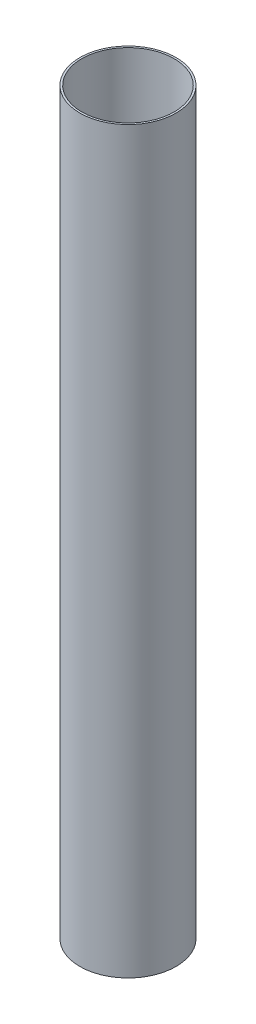
ISO-10303-21;
HEADER;
FILE_DESCRIPTION(('STEP AP214'),'2;1');
FILE_NAME('part.step','',(''),(''),'','','');
FILE_SCHEMA(('AUTOMOTIVE_DESIGN { 1 0 10303 214 1 1 1 1 }'));
ENDSEC;
DATA;
#1=APPLICATION_CONTEXT('core data for automotive mechanical design processes');
#2=APPLICATION_PROTOCOL_DEFINITION('international standard','automotive_design',2000,#1);
#3=PRODUCT_CONTEXT('',#1,'mechanical');
#4=PRODUCT('Part','Part','',(#3));
#5=PRODUCT_RELATED_PRODUCT_CATEGORY('part','',(#4));
#6=PRODUCT_DEFINITION_FORMATION('','',#4);
#7=PRODUCT_DEFINITION_CONTEXT('part definition',#1,'design');
#8=PRODUCT_DEFINITION('design','',#6,#7);
#9=PRODUCT_DEFINITION_SHAPE('','',#8);
#10=(LENGTH_UNIT() NAMED_UNIT(*) SI_UNIT(.MILLI.,.METRE.));
#11=(NAMED_UNIT(*) PLANE_ANGLE_UNIT() SI_UNIT($,.RADIAN.));
#12=(NAMED_UNIT(*) SI_UNIT($,.STERADIAN.) SOLID_ANGLE_UNIT());
#13=UNCERTAINTY_MEASURE_WITH_UNIT(LENGTH_MEASURE(1.E-05),#10,'distance_accuracy_value','');
#14=(GEOMETRIC_REPRESENTATION_CONTEXT(3) GLOBAL_UNCERTAINTY_ASSIGNED_CONTEXT((#13)) GLOBAL_UNIT_ASSIGNED_CONTEXT((#10,
#11,#12)) REPRESENTATION_CONTEXT('',''));
#15=CARTESIAN_POINT('',(0.,0.,0.));
#16=DIRECTION('',(0.,0.,1.));
#17=DIRECTION('',(1.,0.,0.));
#18=AXIS2_PLACEMENT_3D('',#15,#16,#17);
#19=CARTESIAN_POINT('',(0.,1219.2,0.));
#20=DIRECTION('',(0.,1.,0.));
#21=DIRECTION('',(0.,0.,1.));
#22=AXIS2_PLACEMENT_3D('',#19,#20,#21);
#23=PLANE('',#22);
#24=CARTESIAN_POINT('',(0.,1219.2,0.));
#25=DIRECTION('',(0.,1.,0.));
#26=DIRECTION('',(0.,0.,1.));
#27=AXIS2_PLACEMENT_3D('',#24,#25,#26);
#28=CIRCLE('',#27,79.375);
#29=CARTESIAN_POINT('',(0.,1219.2,79.375));
#30=VERTEX_POINT('',#29);
#31=EDGE_CURVE('E10',#30,#30,#28,.T.);
#32=ORIENTED_EDGE('',*,*,#31,.T.);
#33=EDGE_LOOP('',(#32));
#34=FACE_BOUND('',#33,.T.);
#35=CARTESIAN_POINT('',(0.,1219.2,0.));
#36=DIRECTION('',(0.,1.,0.));
#37=DIRECTION('',(0.,0.,1.));
#38=AXIS2_PLACEMENT_3D('',#35,#36,#37);
#39=CIRCLE('',#38,76.2);
#40=CARTESIAN_POINT('',(0.,1219.2,76.2));
#41=VERTEX_POINT('',#40);
#42=EDGE_CURVE('E49',#41,#41,#39,.T.);
#43=ORIENTED_EDGE('',*,*,#42,.F.);
#44=EDGE_LOOP('',(#43));
#45=FACE_BOUND('',#44,.T.);
#46=ADVANCED_FACE('F38',(#34,#45),#23,.T.);
#47=CARTESIAN_POINT('',(0.,0.,0.));
#48=DIRECTION('',(0.,1.,0.));
#49=DIRECTION('',(0.,0.,1.));
#50=AXIS2_PLACEMENT_3D('',#47,#48,#49);
#51=PLANE('',#50);
#52=CARTESIAN_POINT('',(0.,0.,0.));
#53=DIRECTION('',(0.,1.,0.));
#54=DIRECTION('',(0.,0.,1.));
#55=AXIS2_PLACEMENT_3D('',#52,#53,#54);
#56=CIRCLE('',#55,79.375);
#57=CARTESIAN_POINT('',(0.,0.,79.375));
#58=VERTEX_POINT('',#57);
#59=EDGE_CURVE('E42',#58,#58,#56,.T.);
#60=ORIENTED_EDGE('',*,*,#59,.F.);
#61=EDGE_LOOP('',(#60));
#62=FACE_BOUND('',#61,.T.);
#63=CARTESIAN_POINT('',(0.,0.,0.));
#64=DIRECTION('',(0.,1.,0.));
#65=DIRECTION('',(0.,0.,1.));
#66=AXIS2_PLACEMENT_3D('',#63,#64,#65);
#67=CIRCLE('',#66,76.2);
#68=CARTESIAN_POINT('',(0.,0.,76.2));
#69=VERTEX_POINT('',#68);
#70=EDGE_CURVE('E51',#69,#69,#67,.T.);
#71=ORIENTED_EDGE('',*,*,#70,.T.);
#72=EDGE_LOOP('',(#71));
#73=FACE_BOUND('',#72,.T.);
#74=ADVANCED_FACE('F61',(#62,#73),#51,.F.);
#75=CARTESIAN_POINT('',(0.,1219.2,0.));
#76=DIRECTION('',(0.,-1.,0.));
#77=DIRECTION('',(0.,0.,-1.));
#78=AXIS2_PLACEMENT_3D('',#75,#76,#77);
#79=CYLINDRICAL_SURFACE('',#78,79.375);
#80=ORIENTED_EDGE('',*,*,#31,.F.);
#81=EDGE_LOOP('',(#80));
#82=FACE_BOUND('',#81,.T.);
#83=ORIENTED_EDGE('',*,*,#59,.T.);
#84=EDGE_LOOP('',(#83));
#85=FACE_BOUND('',#84,.T.);
#86=ADVANCED_FACE('F40',(#82,#85),#79,.T.);
#87=CARTESIAN_POINT('',(0.,1219.2,0.));
#88=DIRECTION('',(0.,-1.,0.));
#89=DIRECTION('',(0.,0.,-1.));
#90=AXIS2_PLACEMENT_3D('',#87,#88,#89);
#91=CYLINDRICAL_SURFACE('',#90,76.2);
#92=ORIENTED_EDGE('',*,*,#42,.T.);
#93=EDGE_LOOP('',(#92));
#94=FACE_BOUND('',#93,.T.);
#95=ORIENTED_EDGE('',*,*,#70,.F.);
#96=EDGE_LOOP('',(#95));
#97=FACE_BOUND('',#96,.T.);
#98=ADVANCED_FACE('F57',(#94,#97),#91,.F.);
#99=CLOSED_SHELL('',(#46,#74,#86,#98));
#100=MANIFOLD_SOLID_BREP('B2',#99);
#101=ADVANCED_BREP_SHAPE_REPRESENTATION('',(#18,#100),#14);
#102=SHAPE_DEFINITION_REPRESENTATION(#9,#101);
ENDSEC;
END-ISO-10303-21;
